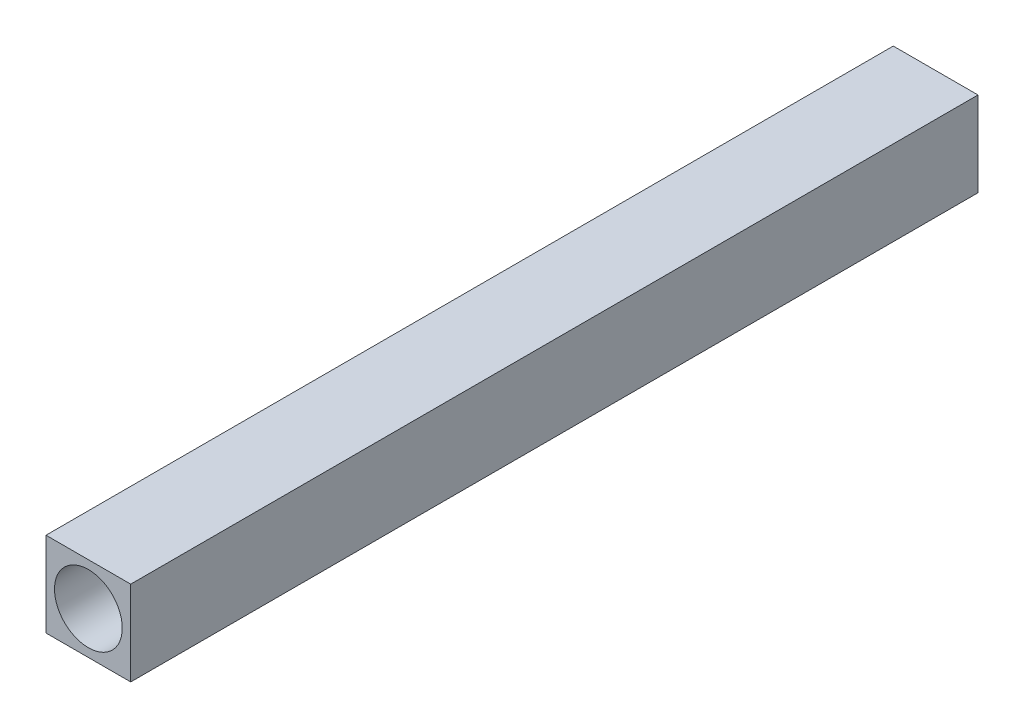
ISO-10303-21;
HEADER;
FILE_DESCRIPTION(('STEP AP214'),'2;1');
FILE_NAME('part.step','',(''),(''),'','','');
FILE_SCHEMA(('AUTOMOTIVE_DESIGN { 1 0 10303 214 1 1 1 1 }'));
ENDSEC;
DATA;
#1=APPLICATION_CONTEXT('core data for automotive mechanical design processes');
#2=APPLICATION_PROTOCOL_DEFINITION('international standard','automotive_design',2000,#1);
#3=PRODUCT_CONTEXT('',#1,'mechanical');
#4=PRODUCT('Part','Part','',(#3));
#5=PRODUCT_RELATED_PRODUCT_CATEGORY('part','',(#4));
#6=PRODUCT_DEFINITION_FORMATION('','',#4);
#7=PRODUCT_DEFINITION_CONTEXT('part definition',#1,'design');
#8=PRODUCT_DEFINITION('design','',#6,#7);
#9=PRODUCT_DEFINITION_SHAPE('','',#8);
#10=(LENGTH_UNIT() NAMED_UNIT(*) SI_UNIT(.MILLI.,.METRE.));
#11=(NAMED_UNIT(*) PLANE_ANGLE_UNIT() SI_UNIT($,.RADIAN.));
#12=(NAMED_UNIT(*) SI_UNIT($,.STERADIAN.) SOLID_ANGLE_UNIT());
#13=UNCERTAINTY_MEASURE_WITH_UNIT(LENGTH_MEASURE(1.E-05),#10,'distance_accuracy_value','');
#14=(GEOMETRIC_REPRESENTATION_CONTEXT(3) GLOBAL_UNCERTAINTY_ASSIGNED_CONTEXT((#13)) GLOBAL_UNIT_ASSIGNED_CONTEXT((#10,
#11,#12)) REPRESENTATION_CONTEXT('',''));
#15=CARTESIAN_POINT('',(0.,0.,0.));
#16=DIRECTION('',(0.,0.,1.));
#17=DIRECTION('',(1.,0.,0.));
#18=AXIS2_PLACEMENT_3D('',#15,#16,#17);
#19=CARTESIAN_POINT('',(-5.,5.,100.));
#20=DIRECTION('',(1.,0.,0.));
#21=DIRECTION('',(0.,1.,0.));
#22=AXIS2_PLACEMENT_3D('',#19,#20,#21);
#23=PLANE('',#22);
#24=DIRECTION('',(0.,-1.,0.));
#25=VECTOR('',#24,1.);
#26=CARTESIAN_POINT('',(-5.,5.,0.));
#27=LINE('',#26,#25);
#28=CARTESIAN_POINT('',(-5.,5.,0.));
#29=VERTEX_POINT('',#28);
#30=CARTESIAN_POINT('',(-5.,-5.,0.));
#31=VERTEX_POINT('',#30);
#32=EDGE_CURVE('E97',#29,#31,#27,.T.);
#33=ORIENTED_EDGE('',*,*,#32,.T.);
#34=DIRECTION('',(0.,0.,-1.));
#35=VECTOR('',#34,1.);
#36=CARTESIAN_POINT('',(-5.,-5.,100.));
#37=LINE('',#36,#35);
#38=CARTESIAN_POINT('',(-5.,-5.,100.));
#39=VERTEX_POINT('',#38);
#40=EDGE_CURVE('E11',#39,#31,#37,.T.);
#41=ORIENTED_EDGE('',*,*,#40,.F.);
#42=DIRECTION('',(0.,-1.,0.));
#43=VECTOR('',#42,1.);
#44=CARTESIAN_POINT('',(-5.,5.,100.));
#45=LINE('',#44,#43);
#46=CARTESIAN_POINT('',(-5.,5.,100.));
#47=VERTEX_POINT('',#46);
#48=EDGE_CURVE('E85',#47,#39,#45,.T.);
#49=ORIENTED_EDGE('',*,*,#48,.F.);
#50=DIRECTION('',(0.,0.,-1.));
#51=VECTOR('',#50,1.);
#52=CARTESIAN_POINT('',(-5.,5.,100.));
#53=LINE('',#52,#51);
#54=EDGE_CURVE('E93',#47,#29,#53,.T.);
#55=ORIENTED_EDGE('',*,*,#54,.T.);
#56=EDGE_LOOP('',(#33,#41,#49,#55));
#57=FACE_BOUND('',#56,.T.);
#58=ADVANCED_FACE('F34',(#57),#23,.F.);
#59=CARTESIAN_POINT('',(-5.,-5.,100.));
#60=DIRECTION('',(0.,1.,0.));
#61=DIRECTION('',(0.,0.,1.));
#62=AXIS2_PLACEMENT_3D('',#59,#60,#61);
#63=PLANE('',#62);
#64=DIRECTION('',(1.,0.,0.));
#65=VECTOR('',#64,1.);
#66=CARTESIAN_POINT('',(-5.,-5.,0.));
#67=LINE('',#66,#65);
#68=CARTESIAN_POINT('',(5.,-5.,0.));
#69=VERTEX_POINT('',#68);
#70=EDGE_CURVE('E89',#31,#69,#67,.T.);
#71=ORIENTED_EDGE('',*,*,#70,.T.);
#72=DIRECTION('',(0.,0.,-1.));
#73=VECTOR('',#72,1.);
#74=CARTESIAN_POINT('',(5.,-5.,100.));
#75=LINE('',#74,#73);
#76=CARTESIAN_POINT('',(5.,-5.,100.));
#77=VERTEX_POINT('',#76);
#78=EDGE_CURVE('E42',#77,#69,#75,.T.);
#79=ORIENTED_EDGE('',*,*,#78,.F.);
#80=DIRECTION('',(1.,0.,0.));
#81=VECTOR('',#80,1.);
#82=CARTESIAN_POINT('',(-5.,-5.,100.));
#83=LINE('',#82,#81);
#84=EDGE_CURVE('E80',#39,#77,#83,.T.);
#85=ORIENTED_EDGE('',*,*,#84,.F.);
#86=ORIENTED_EDGE('',*,*,#40,.T.);
#87=EDGE_LOOP('',(#71,#79,#85,#86));
#88=FACE_BOUND('',#87,.T.);
#89=ADVANCED_FACE('F88',(#88),#63,.F.);
#90=CARTESIAN_POINT('',(5.,5.,100.));
#91=DIRECTION('',(-1.,0.,0.));
#92=DIRECTION('',(0.,0.,1.));
#93=AXIS2_PLACEMENT_3D('',#90,#91,#92);
#94=PLANE('',#93);
#95=DIRECTION('',(0.,1.,0.));
#96=VECTOR('',#95,1.);
#97=CARTESIAN_POINT('',(5.,5.,0.));
#98=LINE('',#97,#96);
#99=CARTESIAN_POINT('',(5.,5.,0.));
#100=VERTEX_POINT('',#99);
#101=EDGE_CURVE('E67',#69,#100,#98,.T.);
#102=ORIENTED_EDGE('',*,*,#101,.T.);
#103=DIRECTION('',(0.,0.,-1.));
#104=VECTOR('',#103,1.);
#105=CARTESIAN_POINT('',(5.,5.,100.));
#106=LINE('',#105,#104);
#107=CARTESIAN_POINT('',(5.,5.,100.));
#108=VERTEX_POINT('',#107);
#109=EDGE_CURVE('E90',#108,#100,#106,.T.);
#110=ORIENTED_EDGE('',*,*,#109,.F.);
#111=DIRECTION('',(0.,1.,0.));
#112=VECTOR('',#111,1.);
#113=CARTESIAN_POINT('',(5.,5.,100.));
#114=LINE('',#113,#112);
#115=EDGE_CURVE('E83',#77,#108,#114,.T.);
#116=ORIENTED_EDGE('',*,*,#115,.F.);
#117=ORIENTED_EDGE('',*,*,#78,.T.);
#118=EDGE_LOOP('',(#102,#110,#116,#117));
#119=FACE_BOUND('',#118,.T.);
#120=ADVANCED_FACE('F91',(#119),#94,.F.);
#121=CARTESIAN_POINT('',(-5.,5.,100.));
#122=DIRECTION('',(0.,-1.,0.));
#123=DIRECTION('',(0.,0.,-1.));
#124=AXIS2_PLACEMENT_3D('',#121,#122,#123);
#125=PLANE('',#124);
#126=DIRECTION('',(-1.,0.,0.));
#127=VECTOR('',#126,1.);
#128=CARTESIAN_POINT('',(-5.,5.,0.));
#129=LINE('',#128,#127);
#130=EDGE_CURVE('E73',#100,#29,#129,.T.);
#131=ORIENTED_EDGE('',*,*,#130,.T.);
#132=ORIENTED_EDGE('',*,*,#54,.F.);
#133=DIRECTION('',(-1.,0.,0.));
#134=VECTOR('',#133,1.);
#135=CARTESIAN_POINT('',(-5.,5.,100.));
#136=LINE('',#135,#134);
#137=EDGE_CURVE('E50',#108,#47,#136,.T.);
#138=ORIENTED_EDGE('',*,*,#137,.F.);
#139=ORIENTED_EDGE('',*,*,#109,.T.);
#140=EDGE_LOOP('',(#131,#132,#138,#139));
#141=FACE_BOUND('',#140,.T.);
#142=ADVANCED_FACE('F105',(#141),#125,.F.);
#143=CARTESIAN_POINT('',(0.,0.,100.));
#144=DIRECTION('',(0.,0.,1.));
#145=DIRECTION('',(1.,0.,0.));
#146=AXIS2_PLACEMENT_3D('',#143,#144,#145);
#147=PLANE('',#146);
#148=CARTESIAN_POINT('',(0.,0.,100.));
#149=DIRECTION('',(0.,0.,1.));
#150=DIRECTION('',(1.,0.,0.));
#151=AXIS2_PLACEMENT_3D('',#148,#149,#150);
#152=CIRCLE('',#151,4.);
#153=CARTESIAN_POINT('',(4.,0.,100.));
#154=VERTEX_POINT('',#153);
#155=EDGE_CURVE('E111',#154,#154,#152,.T.);
#156=ORIENTED_EDGE('',*,*,#155,.F.);
#157=EDGE_LOOP('',(#156));
#158=FACE_BOUND('',#157,.T.);
#159=ORIENTED_EDGE('',*,*,#48,.T.);
#160=ORIENTED_EDGE('',*,*,#84,.T.);
#161=ORIENTED_EDGE('',*,*,#115,.T.);
#162=ORIENTED_EDGE('',*,*,#137,.T.);
#163=EDGE_LOOP('',(#159,#160,#161,#162));
#164=FACE_BOUND('',#163,.T.);
#165=ADVANCED_FACE('F81',(#158,#164),#147,.T.);
#166=CARTESIAN_POINT('',(0.,0.,0.));
#167=DIRECTION('',(0.,0.,1.));
#168=DIRECTION('',(1.,0.,0.));
#169=AXIS2_PLACEMENT_3D('',#166,#167,#168);
#170=PLANE('',#169);
#171=ORIENTED_EDGE('',*,*,#32,.F.);
#172=ORIENTED_EDGE('',*,*,#130,.F.);
#173=ORIENTED_EDGE('',*,*,#101,.F.);
#174=ORIENTED_EDGE('',*,*,#70,.F.);
#175=EDGE_LOOP('',(#171,#172,#173,#174));
#176=FACE_BOUND('',#175,.T.);
#177=ADVANCED_FACE('F108',(#176),#170,.F.);
#178=CARTESIAN_POINT('',(0.,0.,10.));
#179=DIRECTION('',(0.,0.,1.));
#180=DIRECTION('',(1.,0.,0.));
#181=AXIS2_PLACEMENT_3D('',#178,#179,#180);
#182=CYLINDRICAL_SURFACE('',#181,4.);
#183=CARTESIAN_POINT('',(0.,0.,10.));
#184=DIRECTION('',(0.,0.,1.));
#185=DIRECTION('',(1.,0.,0.));
#186=AXIS2_PLACEMENT_3D('',#183,#184,#185);
#187=CIRCLE('',#186,4.);
#188=CARTESIAN_POINT('',(4.,0.,10.));
#189=VERTEX_POINT('',#188);
#190=EDGE_CURVE('E100',#189,#189,#187,.T.);
#191=ORIENTED_EDGE('',*,*,#190,.F.);
#192=EDGE_LOOP('',(#191));
#193=FACE_BOUND('',#192,.T.);
#194=ORIENTED_EDGE('',*,*,#155,.T.);
#195=EDGE_LOOP('',(#194));
#196=FACE_BOUND('',#195,.T.);
#197=ADVANCED_FACE('F119',(#193,#196),#182,.F.);
#198=CARTESIAN_POINT('',(0.,0.,10.));
#199=DIRECTION('',(0.,0.,1.));
#200=DIRECTION('',(1.,0.,0.));
#201=AXIS2_PLACEMENT_3D('',#198,#199,#200);
#202=PLANE('',#201);
#203=ORIENTED_EDGE('',*,*,#190,.T.);
#204=EDGE_LOOP('',(#203));
#205=FACE_BOUND('',#204,.T.);
#206=ADVANCED_FACE('F117',(#205),#202,.T.);
#207=CLOSED_SHELL('',(#58,#89,#120,#142,#165,#177,#197,#206));
#208=MANIFOLD_SOLID_BREP('B2',#207);
#209=ADVANCED_BREP_SHAPE_REPRESENTATION('',(#18,#208),#14);
#210=SHAPE_DEFINITION_REPRESENTATION(#9,#209);
ENDSEC;
END-ISO-10303-21;
